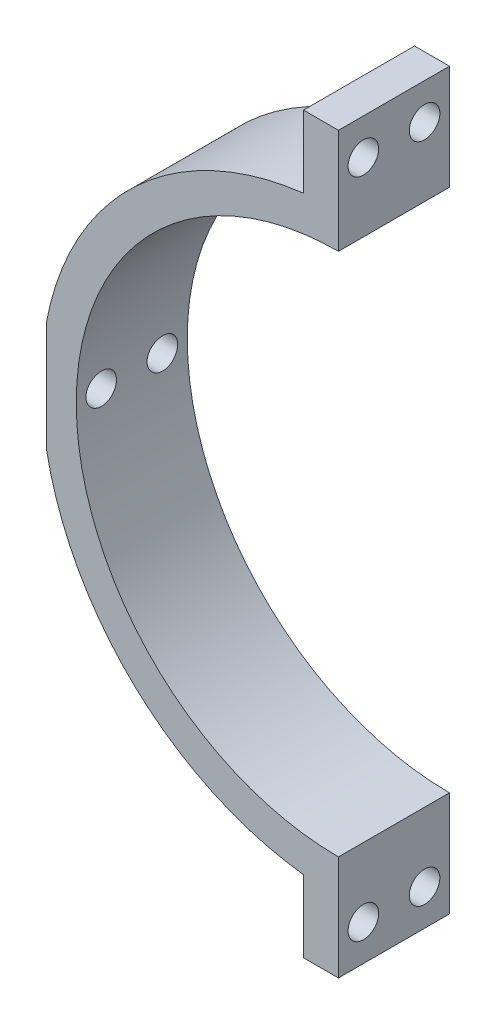
ISO-10303-21;
HEADER;
FILE_DESCRIPTION(('STEP AP214'),'2;1');
FILE_NAME('part.step','',(''),(''),'','','');
FILE_SCHEMA(('AUTOMOTIVE_DESIGN { 1 0 10303 214 1 1 1 1 }'));
ENDSEC;
DATA;
#1=APPLICATION_CONTEXT('core data for automotive mechanical design processes');
#2=APPLICATION_PROTOCOL_DEFINITION('international standard','automotive_design',2000,#1);
#3=PRODUCT_CONTEXT('',#1,'mechanical');
#4=PRODUCT('Part','Part','',(#3));
#5=PRODUCT_RELATED_PRODUCT_CATEGORY('part','',(#4));
#6=PRODUCT_DEFINITION_FORMATION('','',#4);
#7=PRODUCT_DEFINITION_CONTEXT('part definition',#1,'design');
#8=PRODUCT_DEFINITION('design','',#6,#7);
#9=PRODUCT_DEFINITION_SHAPE('','',#8);
#10=(LENGTH_UNIT() NAMED_UNIT(*) SI_UNIT(.MILLI.,.METRE.));
#11=(NAMED_UNIT(*) PLANE_ANGLE_UNIT() SI_UNIT($,.RADIAN.));
#12=(NAMED_UNIT(*) SI_UNIT($,.STERADIAN.) SOLID_ANGLE_UNIT());
#13=UNCERTAINTY_MEASURE_WITH_UNIT(LENGTH_MEASURE(1.E-05),#10,'distance_accuracy_value','');
#14=(GEOMETRIC_REPRESENTATION_CONTEXT(3) GLOBAL_UNCERTAINTY_ASSIGNED_CONTEXT((#13)) GLOBAL_UNIT_ASSIGNED_CONTEXT((#10,
#11,#12)) REPRESENTATION_CONTEXT('',''));
#15=CARTESIAN_POINT('',(0.,0.,0.));
#16=DIRECTION('',(0.,0.,1.));
#17=DIRECTION('',(1.,0.,0.));
#18=AXIS2_PLACEMENT_3D('',#15,#16,#17);
#19=CARTESIAN_POINT('',(-3.99999999999999,0.,12.7));
#20=DIRECTION('',(1.,0.,0.));
#21=DIRECTION('',(0.,1.,0.));
#22=AXIS2_PLACEMENT_3D('',#19,#20,#21);
#23=PLANE('',#22);
#24=CARTESIAN_POINT('',(-4.,37.8819430161341,2.85));
#25=DIRECTION('',(-1.,0.,0.));
#26=DIRECTION('',(0.,-1.,0.));
#27=AXIS2_PLACEMENT_3D('',#24,#25,#26);
#28=CIRCLE('',#27,1.75);
#29=CARTESIAN_POINT('',(-4.,36.1319430161341,2.85));
#30=VERTEX_POINT('',#29);
#31=EDGE_CURVE('E164',#30,#30,#28,.T.);
#32=ORIENTED_EDGE('',*,*,#31,.F.);
#33=EDGE_LOOP('',(#32));
#34=FACE_BOUND('',#33,.T.);
#35=CARTESIAN_POINT('',(-4.,37.8819430161341,9.85));
#36=DIRECTION('',(-1.,0.,0.));
#37=DIRECTION('',(0.,-1.,0.));
#38=AXIS2_PLACEMENT_3D('',#35,#36,#37);
#39=CIRCLE('',#38,1.75);
#40=CARTESIAN_POINT('',(-4.,36.1319430161341,9.85));
#41=VERTEX_POINT('',#40);
#42=EDGE_CURVE('E157',#41,#41,#39,.T.);
#43=ORIENTED_EDGE('',*,*,#42,.F.);
#44=EDGE_LOOP('',(#43));
#45=FACE_BOUND('',#44,.T.);
#46=DIRECTION('',(0.,-1.,0.));
#47=VECTOR('',#46,1.);
#48=CARTESIAN_POINT('',(-3.99999999999999,0.,0.));
#49=LINE('',#48,#47);
#50=CARTESIAN_POINT('',(-4.,42.,0.));
#51=VERTEX_POINT('',#50);
#52=CARTESIAN_POINT('',(-4.,33.7638860322683,0.));
#53=VERTEX_POINT('',#52);
#54=EDGE_CURVE('E167',#51,#53,#49,.T.);
#55=ORIENTED_EDGE('',*,*,#54,.T.);
#56=DIRECTION('',(0.,0.,-1.));
#57=VECTOR('',#56,1.);
#58=CARTESIAN_POINT('',(-4.,33.7638860322683,12.7));
#59=LINE('',#58,#57);
#60=CARTESIAN_POINT('',(-4.,33.7638860322683,12.7));
#61=VERTEX_POINT('',#60);
#62=EDGE_CURVE('E11',#61,#53,#59,.T.);
#63=ORIENTED_EDGE('',*,*,#62,.F.);
#64=DIRECTION('',(0.,-1.,0.));
#65=VECTOR('',#64,1.);
#66=CARTESIAN_POINT('',(-3.99999999999999,0.,12.7));
#67=LINE('',#66,#65);
#68=CARTESIAN_POINT('',(-4.,42.,12.7));
#69=VERTEX_POINT('',#68);
#70=EDGE_CURVE('E152',#69,#61,#67,.T.);
#71=ORIENTED_EDGE('',*,*,#70,.F.);
#72=DIRECTION('',(0.,0.,-1.));
#73=VECTOR('',#72,1.);
#74=CARTESIAN_POINT('',(-4.,42.,12.7));
#75=LINE('',#74,#73);
#76=EDGE_CURVE('E137',#69,#51,#75,.T.);
#77=ORIENTED_EDGE('',*,*,#76,.T.);
#78=EDGE_LOOP('',(#55,#63,#71,#77));
#79=FACE_BOUND('',#78,.T.);
#80=ADVANCED_FACE('F35',(#34,#45,#79),#23,.F.);
#81=CARTESIAN_POINT('',(0.,0.,12.7));
#82=DIRECTION('',(0.,0.,-1.));
#83=DIRECTION('',(-1.,0.,0.));
#84=AXIS2_PLACEMENT_3D('',#81,#82,#83);
#85=CYLINDRICAL_SURFACE('',#84,34.);
#86=CARTESIAN_POINT('',(0.,0.,0.));
#87=DIRECTION('',(0.,0.,1.));
#88=DIRECTION('',(1.,0.,0.));
#89=AXIS2_PLACEMENT_3D('',#86,#87,#88);
#90=CIRCLE('',#89,34.);
#91=CARTESIAN_POINT('',(-33.4017589357207,6.35,0.));
#92=VERTEX_POINT('',#91);
#93=EDGE_CURVE('E228',#53,#92,#90,.T.);
#94=ORIENTED_EDGE('',*,*,#93,.T.);
#95=DIRECTION('',(0.,0.,-1.));
#96=VECTOR('',#95,1.);
#97=CARTESIAN_POINT('',(-33.4017589357207,6.35,12.7));
#98=LINE('',#97,#96);
#99=CARTESIAN_POINT('',(-33.4017589357207,6.35,12.7));
#100=VERTEX_POINT('',#99);
#101=EDGE_CURVE('E43',#100,#92,#98,.T.);
#102=ORIENTED_EDGE('',*,*,#101,.F.);
#103=CARTESIAN_POINT('',(0.,0.,12.7));
#104=DIRECTION('',(0.,0.,1.));
#105=DIRECTION('',(1.,0.,0.));
#106=AXIS2_PLACEMENT_3D('',#103,#104,#105);
#107=CIRCLE('',#106,34.);
#108=EDGE_CURVE('E96',#61,#100,#107,.T.);
#109=ORIENTED_EDGE('',*,*,#108,.F.);
#110=ORIENTED_EDGE('',*,*,#62,.T.);
#111=EDGE_LOOP('',(#94,#102,#109,#110));
#112=FACE_BOUND('',#111,.T.);
#113=ADVANCED_FACE('F215',(#112),#85,.T.);
#114=CARTESIAN_POINT('',(-33.4017589357207,0.,12.7));
#115=DIRECTION('',(-1.,0.,0.));
#116=DIRECTION('',(0.,0.,1.));
#117=AXIS2_PLACEMENT_3D('',#114,#115,#116);
#118=PLANE('',#117);
#119=CARTESIAN_POINT('',(-33.4017589357207,0.,2.85));
#120=DIRECTION('',(-1.,0.,0.));
#121=DIRECTION('',(0.,0.,1.));
#122=AXIS2_PLACEMENT_3D('',#119,#120,#121);
#123=CIRCLE('',#122,1.75);
#124=CARTESIAN_POINT('',(-33.4017589357207,0.,4.6));
#125=VERTEX_POINT('',#124);
#126=EDGE_CURVE('E175',#125,#125,#123,.T.);
#127=ORIENTED_EDGE('',*,*,#126,.F.);
#128=EDGE_LOOP('',(#127));
#129=FACE_BOUND('',#128,.T.);
#130=CARTESIAN_POINT('',(-33.4017589357207,0.,9.85));
#131=DIRECTION('',(-1.,0.,0.));
#132=DIRECTION('',(0.,0.,1.));
#133=AXIS2_PLACEMENT_3D('',#130,#131,#132);
#134=CIRCLE('',#133,1.75);
#135=CARTESIAN_POINT('',(-33.4017589357207,0.,11.6));
#136=VERTEX_POINT('',#135);
#137=EDGE_CURVE('E188',#136,#136,#134,.T.);
#138=ORIENTED_EDGE('',*,*,#137,.F.);
#139=EDGE_LOOP('',(#138));
#140=FACE_BOUND('',#139,.T.);
#141=DIRECTION('',(0.,1.,0.));
#142=VECTOR('',#141,1.);
#143=CARTESIAN_POINT('',(-33.4017589357207,0.,0.));
#144=LINE('',#143,#142);
#145=CARTESIAN_POINT('',(-33.4017589357207,-6.35,0.));
#146=VERTEX_POINT('',#145);
#147=EDGE_CURVE('E221',#146,#92,#144,.T.);
#148=ORIENTED_EDGE('',*,*,#147,.F.);
#149=DIRECTION('',(0.,0.,-1.));
#150=VECTOR('',#149,1.);
#151=CARTESIAN_POINT('',(-33.4017589357207,-6.35,12.7));
#152=LINE('',#151,#150);
#153=CARTESIAN_POINT('',(-33.4017589357207,-6.35,12.7));
#154=VERTEX_POINT('',#153);
#155=EDGE_CURVE('E222',#154,#146,#152,.T.);
#156=ORIENTED_EDGE('',*,*,#155,.F.);
#157=DIRECTION('',(0.,1.,0.));
#158=VECTOR('',#157,1.);
#159=CARTESIAN_POINT('',(-33.4017589357207,0.,12.7));
#160=LINE('',#159,#158);
#161=EDGE_CURVE('E148',#154,#100,#160,.T.);
#162=ORIENTED_EDGE('',*,*,#161,.T.);
#163=ORIENTED_EDGE('',*,*,#101,.T.);
#164=EDGE_LOOP('',(#148,#156,#162,#163));
#165=FACE_BOUND('',#164,.T.);
#166=ADVANCED_FACE('F211',(#129,#140,#165),#118,.T.);
#167=CARTESIAN_POINT('',(-3.99999999999999,-33.7638860322683,0.));
#168=VERTEX_POINT('',#167);
#169=EDGE_CURVE('E227',#146,#168,#90,.T.);
#170=ORIENTED_EDGE('',*,*,#169,.T.);
#171=DIRECTION('',(0.,0.,-1.));
#172=VECTOR('',#171,1.);
#173=CARTESIAN_POINT('',(-3.99999999999999,-33.7638860322683,12.7));
#174=LINE('',#173,#172);
#175=CARTESIAN_POINT('',(-3.99999999999999,-33.7638860322683,12.7));
#176=VERTEX_POINT('',#175);
#177=EDGE_CURVE('E252',#176,#168,#174,.T.);
#178=ORIENTED_EDGE('',*,*,#177,.F.);
#179=EDGE_CURVE('E145',#154,#176,#107,.T.);
#180=ORIENTED_EDGE('',*,*,#179,.F.);
#181=ORIENTED_EDGE('',*,*,#155,.T.);
#182=EDGE_LOOP('',(#170,#178,#180,#181));
#183=FACE_BOUND('',#182,.T.);
#184=ADVANCED_FACE('F214',(#183),#85,.T.);
#185=CARTESIAN_POINT('',(-3.99999999999999,0.,12.7));
#186=DIRECTION('',(1.,0.,0.));
#187=DIRECTION('',(0.,0.,-1.));
#188=AXIS2_PLACEMENT_3D('',#185,#186,#187);
#189=PLANE('',#188);
#190=CARTESIAN_POINT('',(-4.,-37.8819430161341,2.85));
#191=DIRECTION('',(1.,0.,0.));
#192=DIRECTION('',(0.,1.,0.));
#193=AXIS2_PLACEMENT_3D('',#190,#191,#192);
#194=CIRCLE('',#193,1.75);
#195=CARTESIAN_POINT('',(-4.,-36.1319430161341,2.85));
#196=VERTEX_POINT('',#195);
#197=EDGE_CURVE('E171',#196,#196,#194,.T.);
#198=ORIENTED_EDGE('',*,*,#197,.T.);
#199=EDGE_LOOP('',(#198));
#200=FACE_BOUND('',#199,.T.);
#201=CARTESIAN_POINT('',(-4.,-37.8819430161341,9.85));
#202=DIRECTION('',(1.,0.,0.));
#203=DIRECTION('',(0.,1.,0.));
#204=AXIS2_PLACEMENT_3D('',#201,#202,#203);
#205=CIRCLE('',#204,1.75);
#206=CARTESIAN_POINT('',(-4.,-36.1319430161341,9.85));
#207=VERTEX_POINT('',#206);
#208=EDGE_CURVE('E172',#207,#207,#205,.T.);
#209=ORIENTED_EDGE('',*,*,#208,.T.);
#210=EDGE_LOOP('',(#209));
#211=FACE_BOUND('',#210,.T.);
#212=DIRECTION('',(0.,-1.,0.));
#213=VECTOR('',#212,1.);
#214=CARTESIAN_POINT('',(-3.99999999999999,0.,0.));
#215=LINE('',#214,#213);
#216=CARTESIAN_POINT('',(-3.99999999999999,-42.,0.));
#217=VERTEX_POINT('',#216);
#218=EDGE_CURVE('E230',#168,#217,#215,.T.);
#219=ORIENTED_EDGE('',*,*,#218,.T.);
#220=DIRECTION('',(0.,0.,-1.));
#221=VECTOR('',#220,1.);
#222=CARTESIAN_POINT('',(-3.99999999999999,-42.,12.7));
#223=LINE('',#222,#221);
#224=CARTESIAN_POINT('',(-3.99999999999999,-42.,12.7));
#225=VERTEX_POINT('',#224);
#226=EDGE_CURVE('E249',#225,#217,#223,.T.);
#227=ORIENTED_EDGE('',*,*,#226,.F.);
#228=DIRECTION('',(0.,-1.,0.));
#229=VECTOR('',#228,1.);
#230=CARTESIAN_POINT('',(-3.99999999999999,0.,12.7));
#231=LINE('',#230,#229);
#232=EDGE_CURVE('E142',#176,#225,#231,.T.);
#233=ORIENTED_EDGE('',*,*,#232,.F.);
#234=ORIENTED_EDGE('',*,*,#177,.T.);
#235=EDGE_LOOP('',(#219,#227,#233,#234));
#236=FACE_BOUND('',#235,.T.);
#237=ADVANCED_FACE('F264',(#200,#211,#236),#189,.F.);
#238=CARTESIAN_POINT('',(0.,-42.,12.7));
#239=DIRECTION('',(0.,1.,0.));
#240=DIRECTION('',(0.,0.,1.));
#241=AXIS2_PLACEMENT_3D('',#238,#239,#240);
#242=PLANE('',#241);
#243=DIRECTION('',(1.,0.,0.));
#244=VECTOR('',#243,1.);
#245=CARTESIAN_POINT('',(0.,-42.,0.));
#246=LINE('',#245,#244);
#247=CARTESIAN_POINT('',(0.,-42.,0.));
#248=VERTEX_POINT('',#247);
#249=EDGE_CURVE('E235',#217,#248,#246,.T.);
#250=ORIENTED_EDGE('',*,*,#249,.T.);
#251=DIRECTION('',(0.,0.,-1.));
#252=VECTOR('',#251,1.);
#253=CARTESIAN_POINT('',(0.,-42.,12.7));
#254=LINE('',#253,#252);
#255=CARTESIAN_POINT('',(0.,-42.,12.7));
#256=VERTEX_POINT('',#255);
#257=EDGE_CURVE('E247',#256,#248,#254,.T.);
#258=ORIENTED_EDGE('',*,*,#257,.F.);
#259=DIRECTION('',(1.,0.,0.));
#260=VECTOR('',#259,1.);
#261=CARTESIAN_POINT('',(0.,-42.,12.7));
#262=LINE('',#261,#260);
#263=EDGE_CURVE('E140',#225,#256,#262,.T.);
#264=ORIENTED_EDGE('',*,*,#263,.F.);
#265=ORIENTED_EDGE('',*,*,#226,.T.);
#266=EDGE_LOOP('',(#250,#258,#264,#265));
#267=FACE_BOUND('',#266,.T.);
#268=ADVANCED_FACE('F267',(#267),#242,.F.);
#269=CARTESIAN_POINT('',(0.,0.,12.7));
#270=DIRECTION('',(1.,0.,0.));
#271=DIRECTION('',(0.,1.,0.));
#272=AXIS2_PLACEMENT_3D('',#269,#270,#271);
#273=PLANE('',#272);
#274=CARTESIAN_POINT('',(0.,-37.8819430161341,2.85));
#275=DIRECTION('',(1.,0.,0.));
#276=DIRECTION('',(0.,1.,0.));
#277=AXIS2_PLACEMENT_3D('',#274,#275,#276);
#278=CIRCLE('',#277,1.75);
#279=CARTESIAN_POINT('',(0.,-36.1319430161341,2.85));
#280=VERTEX_POINT('',#279);
#281=EDGE_CURVE('E158',#280,#280,#278,.T.);
#282=ORIENTED_EDGE('',*,*,#281,.F.);
#283=EDGE_LOOP('',(#282));
#284=FACE_BOUND('',#283,.T.);
#285=CARTESIAN_POINT('',(0.,-37.8819430161341,9.85));
#286=DIRECTION('',(1.,0.,0.));
#287=DIRECTION('',(0.,1.,0.));
#288=AXIS2_PLACEMENT_3D('',#285,#286,#287);
#289=CIRCLE('',#288,1.75);
#290=CARTESIAN_POINT('',(0.,-36.1319430161341,9.85));
#291=VERTEX_POINT('',#290);
#292=EDGE_CURVE('E168',#291,#291,#289,.T.);
#293=ORIENTED_EDGE('',*,*,#292,.F.);
#294=EDGE_LOOP('',(#293));
#295=FACE_BOUND('',#294,.T.);
#296=DIRECTION('',(0.,-1.,0.));
#297=VECTOR('',#296,1.);
#298=CARTESIAN_POINT('',(0.,0.,0.));
#299=LINE('',#298,#297);
#300=CARTESIAN_POINT('',(0.,-30.,0.));
#301=VERTEX_POINT('',#300);
#302=EDGE_CURVE('E238',#301,#248,#299,.T.);
#303=ORIENTED_EDGE('',*,*,#302,.F.);
#304=DIRECTION('',(0.,0.,-1.));
#305=VECTOR('',#304,1.);
#306=CARTESIAN_POINT('',(0.,-30.,12.7));
#307=LINE('',#306,#305);
#308=CARTESIAN_POINT('',(0.,-30.,12.7));
#309=VERTEX_POINT('',#308);
#310=EDGE_CURVE('E127',#309,#301,#307,.T.);
#311=ORIENTED_EDGE('',*,*,#310,.F.);
#312=DIRECTION('',(0.,-1.,0.));
#313=VECTOR('',#312,1.);
#314=CARTESIAN_POINT('',(0.,0.,12.7));
#315=LINE('',#314,#313);
#316=EDGE_CURVE('E133',#309,#256,#315,.T.);
#317=ORIENTED_EDGE('',*,*,#316,.T.);
#318=ORIENTED_EDGE('',*,*,#257,.T.);
#319=EDGE_LOOP('',(#303,#311,#317,#318));
#320=FACE_BOUND('',#319,.T.);
#321=ADVANCED_FACE('F269',(#284,#295,#320),#273,.T.);
#322=CARTESIAN_POINT('',(0.,0.,12.7));
#323=DIRECTION('',(0.,0.,-1.));
#324=DIRECTION('',(-1.,0.,0.));
#325=AXIS2_PLACEMENT_3D('',#322,#323,#324);
#326=CYLINDRICAL_SURFACE('',#325,30.);
#327=CARTESIAN_POINT('',(-30.,0.,4.6));
#328=CARTESIAN_POINT('',(-29.9999993198971,0.0982086658535025,4.59999567403102));
#329=CARTESIAN_POINT('',(-29.9995125928463,0.196486412507519,4.59170513192777));
#330=CARTESIAN_POINT('',(-29.9976177349364,0.390329142468536,4.55875100337933));
#331=CARTESIAN_POINT('',(-29.9962085269487,0.485890818101563,4.53406827622011));
#332=CARTESIAN_POINT('',(-29.9926281548567,0.67146546440739,4.46904032664121));
#333=CARTESIAN_POINT('',(-29.9904573878745,0.761481298305397,4.42870326615628));
#334=CARTESIAN_POINT('',(-29.9855981664872,0.933440568733872,4.33352465879651));
#335=CARTESIAN_POINT('',(-29.9829098319849,1.01538586829866,4.27868647024167));
#336=CARTESIAN_POINT('',(-29.977313764607,1.16901022202404,4.15598238217674));
#337=CARTESIAN_POINT('',(-29.9744057799601,1.24067721358189,4.08810139065625));
#338=CARTESIAN_POINT('',(-29.9687003156665,1.37160753753827,3.94126942119351));
#339=CARTESIAN_POINT('',(-29.9659028406037,1.43087035583951,3.86231798465737));
#340=CARTESIAN_POINT('',(-29.9607319695512,1.53534614779073,3.69551937583427));
#341=CARTESIAN_POINT('',(-29.9583588714049,1.58054927014799,3.60766602307416));
#342=CARTESIAN_POINT('',(-29.9543075726082,1.65555943935186,3.42560079954724));
#343=CARTESIAN_POINT('',(-29.9526293652738,1.68536663428856,3.33138898995091));
#344=CARTESIAN_POINT('',(-29.9501594627593,1.72870580388383,3.13939593448322));
#345=CARTESIAN_POINT('',(-29.9493667511902,1.74225643945554,3.04161891428119));
#346=CARTESIAN_POINT('',(-29.9487541878075,1.75275543370972,2.84517510713585));
#347=CARTESIAN_POINT('',(-29.9489343261724,1.74970395999861,2.74650832918511));
#348=CARTESIAN_POINT('',(-29.9502462045731,1.72710085943894,2.55121283516822));
#349=CARTESIAN_POINT('',(-29.9513767806712,1.70756941440262,2.45458177439663));
#350=CARTESIAN_POINT('',(-29.9544602861057,1.65259209101998,2.26597212832307));
#351=CARTESIAN_POINT('',(-29.9564132198506,1.61714612735929,2.17399356796511));
#352=CARTESIAN_POINT('',(-29.9609226874376,1.53132298675299,1.99723495099994));
#353=CARTESIAN_POINT('',(-29.963479591847,1.48093663824678,1.91245935737646));
#354=CARTESIAN_POINT('',(-29.9689084660974,1.36666966898839,1.75256194027836));
#355=CARTESIAN_POINT('',(-29.9717804390087,1.30278891673489,1.67744021089094));
#356=CARTESIAN_POINT('',(-29.9775209513863,1.16323273351479,1.53886551612469));
#357=CARTESIAN_POINT('',(-29.9803894793219,1.08753983273221,1.47543014248313));
#358=CARTESIAN_POINT('',(-29.9857956955912,0.926569293582621,1.36216450060192));
#359=CARTESIAN_POINT('',(-29.9883333838225,0.841291652252448,1.31233423656836));
#360=CARTESIAN_POINT('',(-29.9927921144373,0.663561816104442,1.22769487135355));
#361=CARTESIAN_POINT('',(-29.9947131302375,0.571109312208554,1.19288641770468));
#362=CARTESIAN_POINT('',(-29.9977216667112,0.381658831211496,1.13929041815969));
#363=CARTESIAN_POINT('',(-29.9988091958674,0.28466090038064,1.12050270921727));
#364=CARTESIAN_POINT('',(-30.0000271128008,0.0890256433730416,1.09950326955789));
#365=CARTESIAN_POINT('',(-30.0001589052173,-0.00960906330728461,1.09726721290214));
#366=CARTESIAN_POINT('',(-29.9994542305589,-0.205852202906103,1.10937101900651));
#367=CARTESIAN_POINT('',(-29.9986177678646,-0.303460640465456,1.12371080677696));
#368=CARTESIAN_POINT('',(-29.9960716690353,-0.494812099133862,1.1685391088443));
#369=CARTESIAN_POINT('',(-29.9943626353637,-0.588557739097245,1.1990164815441));
#370=CARTESIAN_POINT('',(-29.9902637170595,-0.769603283194666,1.27524350451645));
#371=CARTESIAN_POINT('',(-29.9878738270883,-0.856903136780993,1.32099327453928));
#372=CARTESIAN_POINT('',(-29.9826783450371,-1.02269049057985,1.42652847676001));
#373=CARTESIAN_POINT('',(-29.9798722725345,-1.10116761969174,1.48633017712681));
#374=CARTESIAN_POINT('',(-29.9741619083102,-1.24697748837388,1.61824797826486));
#375=CARTESIAN_POINT('',(-29.9712576157426,-1.31431013193978,1.69036418510875));
#376=CARTESIAN_POINT('',(-29.9656741009868,-1.43600192616075,1.8449687280668));
#377=CARTESIAN_POINT('',(-29.9629951548522,-1.49034531051036,1.92746948542551));
#378=CARTESIAN_POINT('',(-29.9581688114735,-1.58440816446136,2.10043869049577));
#379=CARTESIAN_POINT('',(-29.9560214112951,-1.6241277147915,2.19090709421967));
#380=CARTESIAN_POINT('',(-29.9525023064238,-1.68778803817125,2.37718564400744));
#381=CARTESIAN_POINT('',(-29.9511301117304,-1.71173878013056,2.47299237358838));
#382=CARTESIAN_POINT('',(-29.9493147948526,-1.74321418760874,2.66727555594147));
#383=CARTESIAN_POINT('',(-29.9488716648631,-1.75073899112044,2.76575198627867));
#384=CARTESIAN_POINT('',(-29.9489646380799,-1.74914761089566,2.96242236654296));
#385=CARTESIAN_POINT('',(-29.9494992824212,-1.74005621897149,3.06061651872939));
#386=CARTESIAN_POINT('',(-29.9514844644986,-1.70554186619592,3.25408164743907));
#387=CARTESIAN_POINT('',(-29.9529350039275,-1.68011887515801,3.34935261855893));
#388=CARTESIAN_POINT('',(-29.9565881567034,-1.6136684078718,3.53427119589848));
#389=CARTESIAN_POINT('',(-29.9587907690685,-1.57264095199594,3.62391880945959));
#390=CARTESIAN_POINT('',(-29.963699790211,-1.47614982297962,3.79505612067493));
#391=CARTESIAN_POINT('',(-29.9664061850779,-1.42068654842154,3.87654604348232));
#392=CARTESIAN_POINT('',(-29.9720224504817,-1.29680727446474,4.02917999166821));
#393=CARTESIAN_POINT('',(-29.9749325963959,-1.22837352322534,4.10030959880229));
#394=CARTESIAN_POINT('',(-29.9806261683572,-1.08051651328015,4.23009470456379));
#395=CARTESIAN_POINT('',(-29.983409563165,-1.00109056470155,4.28874714099398));
#396=CARTESIAN_POINT('',(-29.988538531761,-0.833423457566171,4.39195048271987));
#397=CARTESIAN_POINT('',(-29.990883604327,-0.745172382266154,4.43648528447302));
#398=CARTESIAN_POINT('',(-29.9948647161489,-0.562496733292105,4.51005156611449));
#399=CARTESIAN_POINT('',(-29.996501587912,-0.468079559182202,4.53910125850122));
#400=CARTESIAN_POINT('',(-29.998451476827,-0.310901254721715,4.57329754226983));
#401=CARTESIAN_POINT('',(-29.9990296025746,-0.249156876489155,4.58329807463007));
#402=CARTESIAN_POINT('',(-29.9998040803065,-0.124950987819974,4.59665067583481));
#403=CARTESIAN_POINT('',(-30.0000004327447,-0.0624894782360103,4.60000275258341));
#404=CARTESIAN_POINT('',(-30.,0.,4.6));
#405=B_SPLINE_CURVE_WITH_KNOTS('',3,(#327,#328,#329,#330,#331,#332,#333,#334,#335,#336,#337,
#338,#339,#340,#341,#342,#343,#344,#345,#346,#347,#348,#349,#350,#351,#352,#353,#354,#355,#356,
#357,#358,#359,#360,#361,#362,#363,#364,#365,#366,#367,#368,#369,#370,#371,#372,#373,#374,#375,
#376,#377,#378,#379,#380,#381,#382,#383,#384,#385,#386,#387,#388,#389,#390,#391,#392,#393,#394,
#395,#396,#397,#398,#399,#400,#401,#402,#403,#404),.UNSPECIFIED.,.T.,.F.,(4,2,2,2,2,2,2,2,2,2,2,
2,2,2,2,2,2,2,2,2,2,2,2,2,2,2,2,2,2,2,2,2,2,2,2,2,2,2,4),(0.,0.294397878832231,
0.589140123993487,0.883728900977042,1.17824951372897,1.47311299538965,1.76798869539916,
2.06307054472482,2.35814955566938,2.65288952016555,2.94762650912294,3.24200307829414,
3.53638122557454,3.83094046032069,4.12550256564332,4.42050452209809,4.71550656975431,
5.01052133254261,5.30553309287116,5.60011118860561,5.89468795166424,6.1890615998018,
6.48343755616581,6.77815601068985,7.07287700393873,7.36795393197249,7.66302923105241,
7.9579178063976,8.25280390440101,8.5472503835072,8.84169740685506,9.13614404578833,
9.43058255571994,9.72542699294137,10.0203437087956,10.3155956263995,10.6104995189365,
10.7978230260158,10.9851463103934),.UNSPECIFIED.);
#406=CARTESIAN_POINT('',(-30.,0.,4.6));
#407=VERTEX_POINT('',#406);
#408=EDGE_CURVE('E201',#407,#407,#405,.T.);
#409=ORIENTED_EDGE('',*,*,#408,.T.);
#410=EDGE_LOOP('',(#409));
#411=FACE_BOUND('',#410,.T.);
#412=CARTESIAN_POINT('',(-30.,0.,11.6));
#413=CARTESIAN_POINT('',(-29.9999993198971,0.0982086658535025,11.599995674031));
#414=CARTESIAN_POINT('',(-29.9995125928463,0.196486412507519,11.5917051319278));
#415=CARTESIAN_POINT('',(-29.9976177349364,0.390329142468536,11.5587510033793));
#416=CARTESIAN_POINT('',(-29.9962085269487,0.485890818101563,11.5340682762201));
#417=CARTESIAN_POINT('',(-29.9926281548567,0.67146546440739,11.4690403266412));
#418=CARTESIAN_POINT('',(-29.9904573878745,0.761481298305397,11.4287032661563));
#419=CARTESIAN_POINT('',(-29.9855981664872,0.933440568733873,11.3335246587965));
#420=CARTESIAN_POINT('',(-29.9829098319849,1.01538586829866,11.2786864702417));
#421=CARTESIAN_POINT('',(-29.977313764607,1.16901022202404,11.1559823821767));
#422=CARTESIAN_POINT('',(-29.9744057799601,1.24067721358189,11.0881013906563));
#423=CARTESIAN_POINT('',(-29.9687003156665,1.37160753753827,10.9412694211935));
#424=CARTESIAN_POINT('',(-29.9659028406037,1.43087035583951,10.8623179846574));
#425=CARTESIAN_POINT('',(-29.9607319695512,1.53534614779073,10.6955193758343));
#426=CARTESIAN_POINT('',(-29.9583588714049,1.58054927014799,10.6076660230742));
#427=CARTESIAN_POINT('',(-29.9543075726082,1.65555943935186,10.4256007995472));
#428=CARTESIAN_POINT('',(-29.9526293652738,1.68536663428856,10.3313889899509));
#429=CARTESIAN_POINT('',(-29.9501594627593,1.72870580388383,10.1393959344832));
#430=CARTESIAN_POINT('',(-29.9493667511902,1.74225643945554,10.0416189142812));
#431=CARTESIAN_POINT('',(-29.9487541878075,1.75275543370971,9.84517510713585));
#432=CARTESIAN_POINT('',(-29.9489343261724,1.74970395999861,9.74650832918511));
#433=CARTESIAN_POINT('',(-29.9502462045731,1.72710085943894,9.55121283516822));
#434=CARTESIAN_POINT('',(-29.9513767806712,1.70756941440262,9.45458177439663));
#435=CARTESIAN_POINT('',(-29.9544602861057,1.65259209101998,9.26597212832307));
#436=CARTESIAN_POINT('',(-29.9564132198506,1.61714612735929,9.17399356796511));
#437=CARTESIAN_POINT('',(-29.9609226874376,1.53132298675299,8.99723495099994));
#438=CARTESIAN_POINT('',(-29.963479591847,1.48093663824678,8.91245935737646));
#439=CARTESIAN_POINT('',(-29.9689084660974,1.36666966898839,8.75256194027836));
#440=CARTESIAN_POINT('',(-29.9717804390087,1.30278891673489,8.67744021089094));
#441=CARTESIAN_POINT('',(-29.9775209513863,1.16323273351478,8.53886551612469));
#442=CARTESIAN_POINT('',(-29.9803894793219,1.08753983273221,8.47543014248313));
#443=CARTESIAN_POINT('',(-29.9857956955912,0.926569293582621,8.36216450060192));
#444=CARTESIAN_POINT('',(-29.9883333838225,0.841291652252447,8.31233423656836));
#445=CARTESIAN_POINT('',(-29.9927921144373,0.663561816104441,8.22769487135355));
#446=CARTESIAN_POINT('',(-29.9947131302375,0.571109312208553,8.19288641770468));
#447=CARTESIAN_POINT('',(-29.9977216667112,0.381658831211496,8.13929041815969));
#448=CARTESIAN_POINT('',(-29.9988091958674,0.284660900380639,8.12050270921727));
#449=CARTESIAN_POINT('',(-30.0000271128008,0.0890256433730412,8.09950326955789));
#450=CARTESIAN_POINT('',(-30.0001589052173,-0.00960906330728485,8.09726721290214));
#451=CARTESIAN_POINT('',(-29.9994542305589,-0.205852202906104,8.10937101900651));
#452=CARTESIAN_POINT('',(-29.9986177678646,-0.303460640465456,8.12371080677696));
#453=CARTESIAN_POINT('',(-29.9960716690353,-0.494812099133863,8.16853910884431));
#454=CARTESIAN_POINT('',(-29.9943626353637,-0.588557739097245,8.1990164815441));
#455=CARTESIAN_POINT('',(-29.9902637170595,-0.769603283194666,8.27524350451645));
#456=CARTESIAN_POINT('',(-29.9878738270883,-0.856903136780993,8.32099327453928));
#457=CARTESIAN_POINT('',(-29.9826783450371,-1.02269049057985,8.42652847676001));
#458=CARTESIAN_POINT('',(-29.9798722725345,-1.10116761969174,8.48633017712681));
#459=CARTESIAN_POINT('',(-29.9741619083102,-1.24697748837388,8.61824797826486));
#460=CARTESIAN_POINT('',(-29.9712576157426,-1.31431013193978,8.69036418510874));
#461=CARTESIAN_POINT('',(-29.9656741009868,-1.43600192616075,8.8449687280668));
#462=CARTESIAN_POINT('',(-29.9629951548522,-1.49034531051036,8.92746948542551));
#463=CARTESIAN_POINT('',(-29.9581688114735,-1.58440816446136,9.10043869049578));
#464=CARTESIAN_POINT('',(-29.9560214112951,-1.6241277147915,9.19090709421967));
#465=CARTESIAN_POINT('',(-29.9525023064238,-1.68778803817125,9.37718564400744));
#466=CARTESIAN_POINT('',(-29.9511301117304,-1.71173878013056,9.47299237358838));
#467=CARTESIAN_POINT('',(-29.9493147948526,-1.74321418760874,9.66727555594147));
#468=CARTESIAN_POINT('',(-29.9488716648631,-1.75073899112044,9.76575198627867));
#469=CARTESIAN_POINT('',(-29.9489646380799,-1.74914761089566,9.96242236654296));
#470=CARTESIAN_POINT('',(-29.9494992824212,-1.74005621897149,10.0606165187294));
#471=CARTESIAN_POINT('',(-29.9514844644986,-1.70554186619592,10.2540816474391));
#472=CARTESIAN_POINT('',(-29.9529350039275,-1.68011887515801,10.3493526185589));
#473=CARTESIAN_POINT('',(-29.9565881567034,-1.6136684078718,10.5342711958985));
#474=CARTESIAN_POINT('',(-29.9587907690685,-1.57264095199594,10.6239188094596));
#475=CARTESIAN_POINT('',(-29.963699790211,-1.47614982297962,10.7950561206749));
#476=CARTESIAN_POINT('',(-29.9664061850779,-1.42068654842154,10.8765460434823));
#477=CARTESIAN_POINT('',(-29.9720224504817,-1.29680727446474,11.0291799916682));
#478=CARTESIAN_POINT('',(-29.9749325963959,-1.22837352322534,11.1003095988023));
#479=CARTESIAN_POINT('',(-29.9806261683572,-1.08051651328015,11.2300947045638));
#480=CARTESIAN_POINT('',(-29.983409563165,-1.00109056470155,11.288747140994));
#481=CARTESIAN_POINT('',(-29.988538531761,-0.83342345756617,11.3919504827199));
#482=CARTESIAN_POINT('',(-29.990883604327,-0.745172382266153,11.436485284473));
#483=CARTESIAN_POINT('',(-29.9948647161489,-0.562496733292104,11.5100515661145));
#484=CARTESIAN_POINT('',(-29.996501587912,-0.468079559182202,11.5391012585012));
#485=CARTESIAN_POINT('',(-29.998451476827,-0.310901254721715,11.5732975422698));
#486=CARTESIAN_POINT('',(-29.9990296025746,-0.249156876489155,11.5832980746301));
#487=CARTESIAN_POINT('',(-29.9998040803065,-0.124950987819974,11.5966506758348));
#488=CARTESIAN_POINT('',(-30.0000004327447,-0.0624894782360103,11.6000027525834));
#489=CARTESIAN_POINT('',(-30.,0.,11.6));
#490=B_SPLINE_CURVE_WITH_KNOTS('',3,(#412,#413,#414,#415,#416,#417,#418,#419,#420,#421,#422,
#423,#424,#425,#426,#427,#428,#429,#430,#431,#432,#433,#434,#435,#436,#437,#438,#439,#440,#441,
#442,#443,#444,#445,#446,#447,#448,#449,#450,#451,#452,#453,#454,#455,#456,#457,#458,#459,#460,
#461,#462,#463,#464,#465,#466,#467,#468,#469,#470,#471,#472,#473,#474,#475,#476,#477,#478,#479,
#480,#481,#482,#483,#484,#485,#486,#487,#488,#489),.UNSPECIFIED.,.T.,.F.,(4,2,2,2,2,2,2,2,2,2,2,
2,2,2,2,2,2,2,2,2,2,2,2,2,2,2,2,2,2,2,2,2,2,2,2,2,2,2,4),(0.,0.294397878832231,
0.589140123993487,0.883728900977042,1.17824951372897,1.47311299538965,1.76798869539916,
2.06307054472482,2.35814955566938,2.65288952016555,2.94762650912294,3.24200307829414,
3.53638122557454,3.83094046032069,4.12550256564332,4.42050452209809,4.71550656975431,
5.01052133254261,5.30553309287116,5.60011118860561,5.89468795166424,6.1890615998018,
6.48343755616581,6.77815601068985,7.07287700393873,7.36795393197249,7.66302923105241,
7.9579178063976,8.252803904401,8.54725038350719,8.84169740685505,9.13614404578832,
9.43058255571993,9.72542699294136,10.0203437087955,10.3155956263995,10.6104995189365,
10.7978230260158,10.9851463103934),.UNSPECIFIED.);
#491=CARTESIAN_POINT('',(-30.,0.,11.6));
#492=VERTEX_POINT('',#491);
#493=EDGE_CURVE('E180',#492,#492,#490,.T.);
#494=ORIENTED_EDGE('',*,*,#493,.T.);
#495=EDGE_LOOP('',(#494));
#496=FACE_BOUND('',#495,.T.);
#497=CARTESIAN_POINT('',(0.,0.,0.));
#498=DIRECTION('',(0.,0.,1.));
#499=DIRECTION('',(1.,0.,0.));
#500=AXIS2_PLACEMENT_3D('',#497,#498,#499);
#501=CIRCLE('',#500,30.);
#502=CARTESIAN_POINT('',(0.,30.,0.));
#503=VERTEX_POINT('',#502);
#504=EDGE_CURVE('E122',#503,#301,#501,.T.);
#505=ORIENTED_EDGE('',*,*,#504,.F.);
#506=DIRECTION('',(0.,0.,-1.));
#507=VECTOR('',#506,1.);
#508=CARTESIAN_POINT('',(0.,30.,12.7));
#509=LINE('',#508,#507);
#510=CARTESIAN_POINT('',(0.,30.,12.7));
#511=VERTEX_POINT('',#510);
#512=EDGE_CURVE('E117',#511,#503,#509,.T.);
#513=ORIENTED_EDGE('',*,*,#512,.F.);
#514=CARTESIAN_POINT('',(0.,0.,12.7));
#515=DIRECTION('',(0.,0.,1.));
#516=DIRECTION('',(1.,0.,0.));
#517=AXIS2_PLACEMENT_3D('',#514,#515,#516);
#518=CIRCLE('',#517,30.);
#519=EDGE_CURVE('E120',#511,#309,#518,.T.);
#520=ORIENTED_EDGE('',*,*,#519,.T.);
#521=ORIENTED_EDGE('',*,*,#310,.T.);
#522=EDGE_LOOP('',(#505,#513,#520,#521));
#523=FACE_BOUND('',#522,.T.);
#524=ADVANCED_FACE('F119',(#411,#496,#523),#326,.F.);
#525=CARTESIAN_POINT('',(0.,37.8819430161341,2.85));
#526=DIRECTION('',(1.,0.,0.));
#527=DIRECTION('',(0.,1.,0.));
#528=AXIS2_PLACEMENT_3D('',#525,#526,#527);
#529=CIRCLE('',#528,1.75);
#530=CARTESIAN_POINT('',(0.,39.6319430161341,2.85));
#531=VERTEX_POINT('',#530);
#532=EDGE_CURVE('E161',#531,#531,#529,.F.);
#533=ORIENTED_EDGE('',*,*,#532,.T.);
#534=EDGE_LOOP('',(#533));
#535=FACE_BOUND('',#534,.T.);
#536=CARTESIAN_POINT('',(0.,37.8819430161341,9.85));
#537=DIRECTION('',(1.,0.,0.));
#538=DIRECTION('',(0.,1.,0.));
#539=AXIS2_PLACEMENT_3D('',#536,#537,#538);
#540=CIRCLE('',#539,1.75);
#541=CARTESIAN_POINT('',(0.,39.6319430161341,9.85));
#542=VERTEX_POINT('',#541);
#543=EDGE_CURVE('E154',#542,#542,#540,.F.);
#544=ORIENTED_EDGE('',*,*,#543,.T.);
#545=EDGE_LOOP('',(#544));
#546=FACE_BOUND('',#545,.T.);
#547=CARTESIAN_POINT('',(0.,42.,0.));
#548=VERTEX_POINT('',#547);
#549=EDGE_CURVE('E241',#548,#503,#299,.T.);
#550=ORIENTED_EDGE('',*,*,#549,.F.);
#551=DIRECTION('',(0.,0.,-1.));
#552=VECTOR('',#551,1.);
#553=CARTESIAN_POINT('',(0.,42.,12.7));
#554=LINE('',#553,#552);
#555=CARTESIAN_POINT('',(0.,42.,12.7));
#556=VERTEX_POINT('',#555);
#557=EDGE_CURVE('E85',#556,#548,#554,.T.);
#558=ORIENTED_EDGE('',*,*,#557,.F.);
#559=EDGE_CURVE('E131',#556,#511,#315,.T.);
#560=ORIENTED_EDGE('',*,*,#559,.T.);
#561=ORIENTED_EDGE('',*,*,#512,.T.);
#562=EDGE_LOOP('',(#550,#558,#560,#561));
#563=FACE_BOUND('',#562,.T.);
#564=ADVANCED_FACE('F135',(#535,#546,#563),#273,.T.);
#565=CARTESIAN_POINT('',(0.,42.,12.7));
#566=DIRECTION('',(0.,-1.,0.));
#567=DIRECTION('',(0.,0.,-1.));
#568=AXIS2_PLACEMENT_3D('',#565,#566,#567);
#569=PLANE('',#568);
#570=DIRECTION('',(-1.,0.,0.));
#571=VECTOR('',#570,1.);
#572=CARTESIAN_POINT('',(0.,42.,0.));
#573=LINE('',#572,#571);
#574=EDGE_CURVE('E88',#548,#51,#573,.T.);
#575=ORIENTED_EDGE('',*,*,#574,.T.);
#576=ORIENTED_EDGE('',*,*,#76,.F.);
#577=DIRECTION('',(-1.,0.,0.));
#578=VECTOR('',#577,1.);
#579=CARTESIAN_POINT('',(0.,42.,12.7));
#580=LINE('',#579,#578);
#581=EDGE_CURVE('E51',#556,#69,#580,.T.);
#582=ORIENTED_EDGE('',*,*,#581,.F.);
#583=ORIENTED_EDGE('',*,*,#557,.T.);
#584=EDGE_LOOP('',(#575,#576,#582,#583));
#585=FACE_BOUND('',#584,.T.);
#586=ADVANCED_FACE('F274',(#585),#569,.F.);
#587=CARTESIAN_POINT('',(0.,0.,12.7));
#588=DIRECTION('',(0.,0.,1.));
#589=DIRECTION('',(1.,0.,0.));
#590=AXIS2_PLACEMENT_3D('',#587,#588,#589);
#591=PLANE('',#590);
#592=ORIENTED_EDGE('',*,*,#70,.T.);
#593=ORIENTED_EDGE('',*,*,#108,.T.);
#594=ORIENTED_EDGE('',*,*,#161,.F.);
#595=ORIENTED_EDGE('',*,*,#179,.T.);
#596=ORIENTED_EDGE('',*,*,#232,.T.);
#597=ORIENTED_EDGE('',*,*,#263,.T.);
#598=ORIENTED_EDGE('',*,*,#316,.F.);
#599=ORIENTED_EDGE('',*,*,#519,.F.);
#600=ORIENTED_EDGE('',*,*,#559,.F.);
#601=ORIENTED_EDGE('',*,*,#581,.T.);
#602=EDGE_LOOP('',(#592,#593,#594,#595,#596,#597,#598,#599,#600,#601));
#603=FACE_BOUND('',#602,.T.);
#604=ADVANCED_FACE('F130',(#603),#591,.T.);
#605=CARTESIAN_POINT('',(0.,0.,0.));
#606=DIRECTION('',(0.,0.,1.));
#607=DIRECTION('',(1.,0.,0.));
#608=AXIS2_PLACEMENT_3D('',#605,#606,#607);
#609=PLANE('',#608);
#610=ORIENTED_EDGE('',*,*,#54,.F.);
#611=ORIENTED_EDGE('',*,*,#574,.F.);
#612=ORIENTED_EDGE('',*,*,#549,.T.);
#613=ORIENTED_EDGE('',*,*,#504,.T.);
#614=ORIENTED_EDGE('',*,*,#302,.T.);
#615=ORIENTED_EDGE('',*,*,#249,.F.);
#616=ORIENTED_EDGE('',*,*,#218,.F.);
#617=ORIENTED_EDGE('',*,*,#169,.F.);
#618=ORIENTED_EDGE('',*,*,#147,.T.);
#619=ORIENTED_EDGE('',*,*,#93,.F.);
#620=EDGE_LOOP('',(#610,#611,#612,#613,#614,#615,#616,#617,#618,#619));
#621=FACE_BOUND('',#620,.T.);
#622=ADVANCED_FACE('F260',(#621),#609,.F.);
#623=CARTESIAN_POINT('',(0.0010000000000062,37.8819430161341,9.85));
#624=DIRECTION('',(-1.,0.,0.));
#625=DIRECTION('',(0.,-1.,0.));
#626=AXIS2_PLACEMENT_3D('',#623,#624,#625);
#627=CYLINDRICAL_SURFACE('',#626,1.75);
#628=ORIENTED_EDGE('',*,*,#543,.F.);
#629=EDGE_LOOP('',(#628));
#630=FACE_BOUND('',#629,.T.);
#631=ORIENTED_EDGE('',*,*,#42,.T.);
#632=EDGE_LOOP('',(#631));
#633=FACE_BOUND('',#632,.T.);
#634=ADVANCED_FACE('F295',(#630,#633),#627,.F.);
#635=CARTESIAN_POINT('',(0.0010000000000062,37.8819430161341,2.85));
#636=DIRECTION('',(-1.,0.,0.));
#637=DIRECTION('',(0.,-1.,0.));
#638=AXIS2_PLACEMENT_3D('',#635,#636,#637);
#639=CYLINDRICAL_SURFACE('',#638,1.75);
#640=ORIENTED_EDGE('',*,*,#532,.F.);
#641=EDGE_LOOP('',(#640));
#642=FACE_BOUND('',#641,.T.);
#643=ORIENTED_EDGE('',*,*,#31,.T.);
#644=EDGE_LOOP('',(#643));
#645=FACE_BOUND('',#644,.T.);
#646=ADVANCED_FACE('F297',(#642,#645),#639,.F.);
#647=CARTESIAN_POINT('',(0.0010000000000062,-37.8819430161341,9.85));
#648=DIRECTION('',(-1.,0.,0.));
#649=DIRECTION('',(0.,-1.,0.));
#650=AXIS2_PLACEMENT_3D('',#647,#648,#649);
#651=CYLINDRICAL_SURFACE('',#650,1.75);
#652=ORIENTED_EDGE('',*,*,#292,.T.);
#653=EDGE_LOOP('',(#652));
#654=FACE_BOUND('',#653,.T.);
#655=ORIENTED_EDGE('',*,*,#208,.F.);
#656=EDGE_LOOP('',(#655));
#657=FACE_BOUND('',#656,.T.);
#658=ADVANCED_FACE('F304',(#654,#657),#651,.F.);
#659=CARTESIAN_POINT('',(0.0010000000000062,-37.8819430161341,2.85));
#660=DIRECTION('',(-1.,0.,0.));
#661=DIRECTION('',(0.,-1.,0.));
#662=AXIS2_PLACEMENT_3D('',#659,#660,#661);
#663=CYLINDRICAL_SURFACE('',#662,1.75);
#664=ORIENTED_EDGE('',*,*,#281,.T.);
#665=EDGE_LOOP('',(#664));
#666=FACE_BOUND('',#665,.T.);
#667=ORIENTED_EDGE('',*,*,#197,.F.);
#668=EDGE_LOOP('',(#667));
#669=FACE_BOUND('',#668,.T.);
#670=ADVANCED_FACE('F310',(#666,#669),#663,.F.);
#671=CARTESIAN_POINT('',(0.00100000000000794,0.,9.85));
#672=DIRECTION('',(-1.,0.,0.));
#673=DIRECTION('',(0.,0.,1.));
#674=AXIS2_PLACEMENT_3D('',#671,#672,#673);
#675=CYLINDRICAL_SURFACE('',#674,1.75);
#676=ORIENTED_EDGE('',*,*,#493,.F.);
#677=EDGE_LOOP('',(#676));
#678=FACE_BOUND('',#677,.T.);
#679=ORIENTED_EDGE('',*,*,#137,.T.);
#680=EDGE_LOOP('',(#679));
#681=FACE_BOUND('',#680,.T.);
#682=ADVANCED_FACE('F190',(#678,#681),#675,.F.);
#683=CARTESIAN_POINT('',(0.00100000000000794,0.,2.85));
#684=DIRECTION('',(-1.,0.,0.));
#685=DIRECTION('',(0.,0.,1.));
#686=AXIS2_PLACEMENT_3D('',#683,#684,#685);
#687=CYLINDRICAL_SURFACE('',#686,1.75);
#688=ORIENTED_EDGE('',*,*,#408,.F.);
#689=EDGE_LOOP('',(#688));
#690=FACE_BOUND('',#689,.T.);
#691=ORIENTED_EDGE('',*,*,#126,.T.);
#692=EDGE_LOOP('',(#691));
#693=FACE_BOUND('',#692,.T.);
#694=ADVANCED_FACE('F195',(#690,#693),#687,.F.);
#695=CLOSED_SHELL('',(#80,#113,#166,#184,#237,#268,#321,#524,#564,#586,#604,#622,#634,#646,#658,
#670,#682,#694));
#696=MANIFOLD_SOLID_BREP('B2',#695);
#697=ADVANCED_BREP_SHAPE_REPRESENTATION('',(#18,#696),#14);
#698=SHAPE_DEFINITION_REPRESENTATION(#9,#697);
ENDSEC;
END-ISO-10303-21;
